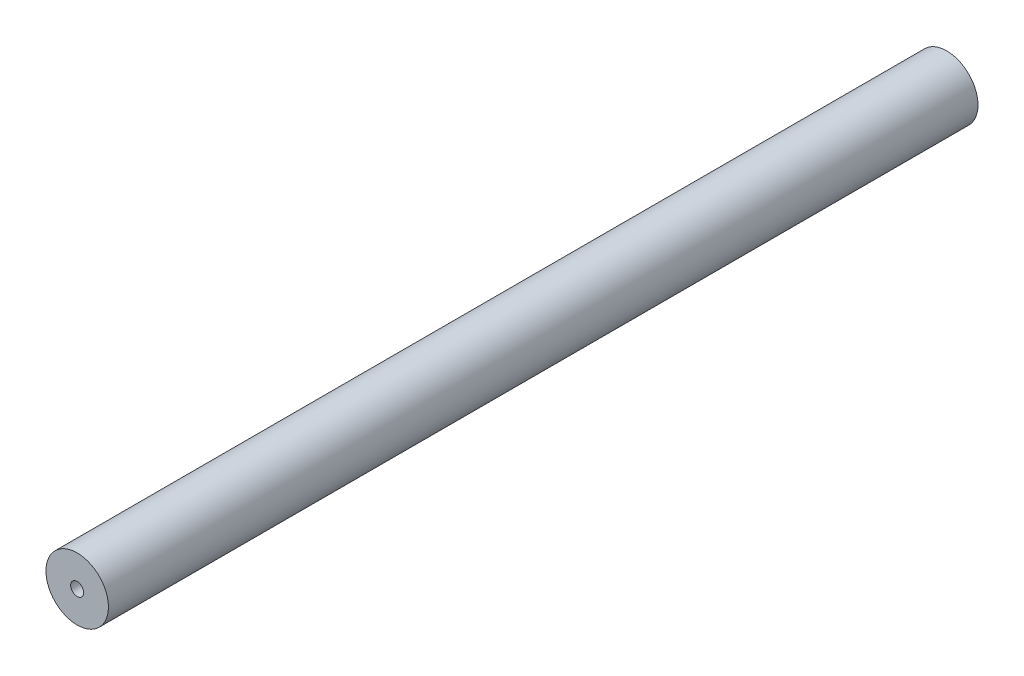
ISO-10303-21;
HEADER;
FILE_DESCRIPTION(('STEP AP214'),'2;1');
FILE_NAME('part.step','',(''),(''),'','','');
FILE_SCHEMA(('AUTOMOTIVE_DESIGN { 1 0 10303 214 1 1 1 1 }'));
ENDSEC;
DATA;
#1=APPLICATION_CONTEXT('core data for automotive mechanical design processes');
#2=APPLICATION_PROTOCOL_DEFINITION('international standard','automotive_design',2000,#1);
#3=PRODUCT_CONTEXT('',#1,'mechanical');
#4=PRODUCT('Part','Part','',(#3));
#5=PRODUCT_RELATED_PRODUCT_CATEGORY('part','',(#4));
#6=PRODUCT_DEFINITION_FORMATION('','',#4);
#7=PRODUCT_DEFINITION_CONTEXT('part definition',#1,'design');
#8=PRODUCT_DEFINITION('design','',#6,#7);
#9=PRODUCT_DEFINITION_SHAPE('','',#8);
#10=(LENGTH_UNIT() NAMED_UNIT(*) SI_UNIT(.MILLI.,.METRE.));
#11=(NAMED_UNIT(*) PLANE_ANGLE_UNIT() SI_UNIT($,.RADIAN.));
#12=(NAMED_UNIT(*) SI_UNIT($,.STERADIAN.) SOLID_ANGLE_UNIT());
#13=UNCERTAINTY_MEASURE_WITH_UNIT(LENGTH_MEASURE(1.E-05),#10,'distance_accuracy_value','');
#14=(GEOMETRIC_REPRESENTATION_CONTEXT(3) GLOBAL_UNCERTAINTY_ASSIGNED_CONTEXT((#13)) GLOBAL_UNIT_ASSIGNED_CONTEXT((#10,
#11,#12)) REPRESENTATION_CONTEXT('',''));
#15=CARTESIAN_POINT('',(0.,0.,0.));
#16=DIRECTION('',(0.,0.,1.));
#17=DIRECTION('',(1.,0.,0.));
#18=AXIS2_PLACEMENT_3D('',#15,#16,#17);
#19=CARTESIAN_POINT('',(0.,0.,83.5));
#20=DIRECTION('',(0.,0.,-1.));
#21=DIRECTION('',(-1.,0.,0.));
#22=AXIS2_PLACEMENT_3D('',#19,#20,#21);
#23=CYLINDRICAL_SURFACE('',#22,6.);
#24=CARTESIAN_POINT('',(0.,0.,83.5));
#25=DIRECTION('',(0.,0.,1.));
#26=DIRECTION('',(1.,0.,0.));
#27=AXIS2_PLACEMENT_3D('',#24,#25,#26);
#28=CIRCLE('',#27,6.);
#29=CARTESIAN_POINT('',(6.,0.,83.5));
#30=VERTEX_POINT('',#29);
#31=EDGE_CURVE('E11',#30,#30,#28,.T.);
#32=ORIENTED_EDGE('',*,*,#31,.F.);
#33=EDGE_LOOP('',(#32));
#34=FACE_BOUND('',#33,.T.);
#35=CARTESIAN_POINT('',(0.,0.,-83.5));
#36=DIRECTION('',(0.,0.,1.));
#37=DIRECTION('',(1.,0.,0.));
#38=AXIS2_PLACEMENT_3D('',#35,#36,#37);
#39=CIRCLE('',#38,6.);
#40=CARTESIAN_POINT('',(6.,0.,-83.5));
#41=VERTEX_POINT('',#40);
#42=EDGE_CURVE('E41',#41,#41,#39,.T.);
#43=ORIENTED_EDGE('',*,*,#42,.T.);
#44=EDGE_LOOP('',(#43));
#45=FACE_BOUND('',#44,.T.);
#46=ADVANCED_FACE('F38',(#34,#45),#23,.T.);
#47=CARTESIAN_POINT('',(0.,0.,83.5));
#48=DIRECTION('',(0.,0.,1.));
#49=DIRECTION('',(1.,0.,0.));
#50=AXIS2_PLACEMENT_3D('',#47,#48,#49);
#51=PLANE('',#50);
#52=CARTESIAN_POINT('',(0.,0.,83.5));
#53=DIRECTION('',(0.,0.,1.));
#54=DIRECTION('',(1.,0.,0.));
#55=AXIS2_PLACEMENT_3D('',#52,#53,#54);
#56=CIRCLE('',#55,1.25);
#57=CARTESIAN_POINT('',(1.25,0.,83.5));
#58=VERTEX_POINT('',#57);
#59=EDGE_CURVE('E63',#58,#58,#56,.T.);
#60=ORIENTED_EDGE('',*,*,#59,.F.);
#61=EDGE_LOOP('',(#60));
#62=FACE_BOUND('',#61,.T.);
#63=ORIENTED_EDGE('',*,*,#31,.T.);
#64=EDGE_LOOP('',(#63));
#65=FACE_BOUND('',#64,.T.);
#66=ADVANCED_FACE('F89',(#62,#65),#51,.T.);
#67=CARTESIAN_POINT('',(0.,0.,-83.5));
#68=DIRECTION('',(0.,0.,1.));
#69=DIRECTION('',(1.,0.,0.));
#70=AXIS2_PLACEMENT_3D('',#67,#68,#69);
#71=PLANE('',#70);
#72=CARTESIAN_POINT('',(0.,0.,-83.5));
#73=DIRECTION('',(0.,0.,-1.));
#74=DIRECTION('',(-1.,0.,0.));
#75=AXIS2_PLACEMENT_3D('',#72,#73,#74);
#76=CIRCLE('',#75,1.25);
#77=CARTESIAN_POINT('',(-1.25,0.,-83.5));
#78=VERTEX_POINT('',#77);
#79=EDGE_CURVE('E64',#78,#78,#76,.T.);
#80=ORIENTED_EDGE('',*,*,#79,.F.);
#81=EDGE_LOOP('',(#80));
#82=FACE_BOUND('',#81,.T.);
#83=ORIENTED_EDGE('',*,*,#42,.F.);
#84=EDGE_LOOP('',(#83));
#85=FACE_BOUND('',#84,.T.);
#86=ADVANCED_FACE('F86',(#82,#85),#71,.F.);
#87=CARTESIAN_POINT('',(0.,0.,73.5));
#88=DIRECTION('',(0.,0.,1.));
#89=DIRECTION('',(1.,0.,0.));
#90=AXIS2_PLACEMENT_3D('',#87,#88,#89);
#91=CONICAL_SURFACE('',#90,1.25,1.02974425867665);
#92=CARTESIAN_POINT('',(0.,0.,72.7489242262155));
#93=VERTEX_POINT('',#92);
#94=VERTEX_LOOP('',#93);
#95=FACE_BOUND('',#94,.T.);
#96=CARTESIAN_POINT('',(0.,0.,73.5));
#97=DIRECTION('',(0.,0.,1.));
#98=DIRECTION('',(1.,0.,0.));
#99=AXIS2_PLACEMENT_3D('',#96,#97,#98);
#100=CIRCLE('',#99,1.25);
#101=CARTESIAN_POINT('',(1.25,0.,73.5));
#102=VERTEX_POINT('',#101);
#103=EDGE_CURVE('E70',#102,#102,#100,.T.);
#104=ORIENTED_EDGE('',*,*,#103,.T.);
#105=EDGE_LOOP('',(#104));
#106=FACE_BOUND('',#105,.T.);
#107=ADVANCED_FACE('F88',(#95,#106),#91,.F.);
#108=CARTESIAN_POINT('',(0.,0.,83.5));
#109=DIRECTION('',(0.,0.,1.));
#110=DIRECTION('',(1.,0.,0.));
#111=AXIS2_PLACEMENT_3D('',#108,#109,#110);
#112=CYLINDRICAL_SURFACE('',#111,1.25);
#113=ORIENTED_EDGE('',*,*,#103,.F.);
#114=EDGE_LOOP('',(#113));
#115=FACE_BOUND('',#114,.T.);
#116=ORIENTED_EDGE('',*,*,#59,.T.);
#117=EDGE_LOOP('',(#116));
#118=FACE_BOUND('',#117,.T.);
#119=ADVANCED_FACE('F56',(#115,#118),#112,.F.);
#120=CARTESIAN_POINT('',(0.,0.,-73.5));
#121=DIRECTION('',(0.,0.,-1.));
#122=DIRECTION('',(-1.,0.,0.));
#123=AXIS2_PLACEMENT_3D('',#120,#121,#122);
#124=CONICAL_SURFACE('',#123,1.25,1.02974425867665);
#125=CARTESIAN_POINT('',(0.,0.,-72.7489242262155));
#126=VERTEX_POINT('',#125);
#127=VERTEX_LOOP('',#126);
#128=FACE_BOUND('',#127,.T.);
#129=CARTESIAN_POINT('',(0.,0.,-73.5));
#130=DIRECTION('',(0.,0.,-1.));
#131=DIRECTION('',(-1.,0.,0.));
#132=AXIS2_PLACEMENT_3D('',#129,#130,#131);
#133=CIRCLE('',#132,1.25);
#134=CARTESIAN_POINT('',(-1.25,0.,-73.5));
#135=VERTEX_POINT('',#134);
#136=EDGE_CURVE('E60',#135,#135,#133,.T.);
#137=ORIENTED_EDGE('',*,*,#136,.T.);
#138=EDGE_LOOP('',(#137));
#139=FACE_BOUND('',#138,.T.);
#140=ADVANCED_FACE('F52',(#128,#139),#124,.F.);
#141=CARTESIAN_POINT('',(0.,0.,-83.5));
#142=DIRECTION('',(0.,0.,-1.));
#143=DIRECTION('',(-1.,0.,0.));
#144=AXIS2_PLACEMENT_3D('',#141,#142,#143);
#145=CYLINDRICAL_SURFACE('',#144,1.25);
#146=ORIENTED_EDGE('',*,*,#136,.F.);
#147=EDGE_LOOP('',(#146));
#148=FACE_BOUND('',#147,.T.);
#149=ORIENTED_EDGE('',*,*,#79,.T.);
#150=EDGE_LOOP('',(#149));
#151=FACE_BOUND('',#150,.T.);
#152=ADVANCED_FACE('F55',(#148,#151),#145,.F.);
#153=CLOSED_SHELL('',(#46,#66,#86,#107,#119,#140,#152));
#154=MANIFOLD_SOLID_BREP('B2',#153);
#155=ADVANCED_BREP_SHAPE_REPRESENTATION('',(#18,#154),#14);
#156=SHAPE_DEFINITION_REPRESENTATION(#9,#155);
ENDSEC;
END-ISO-10303-21;
